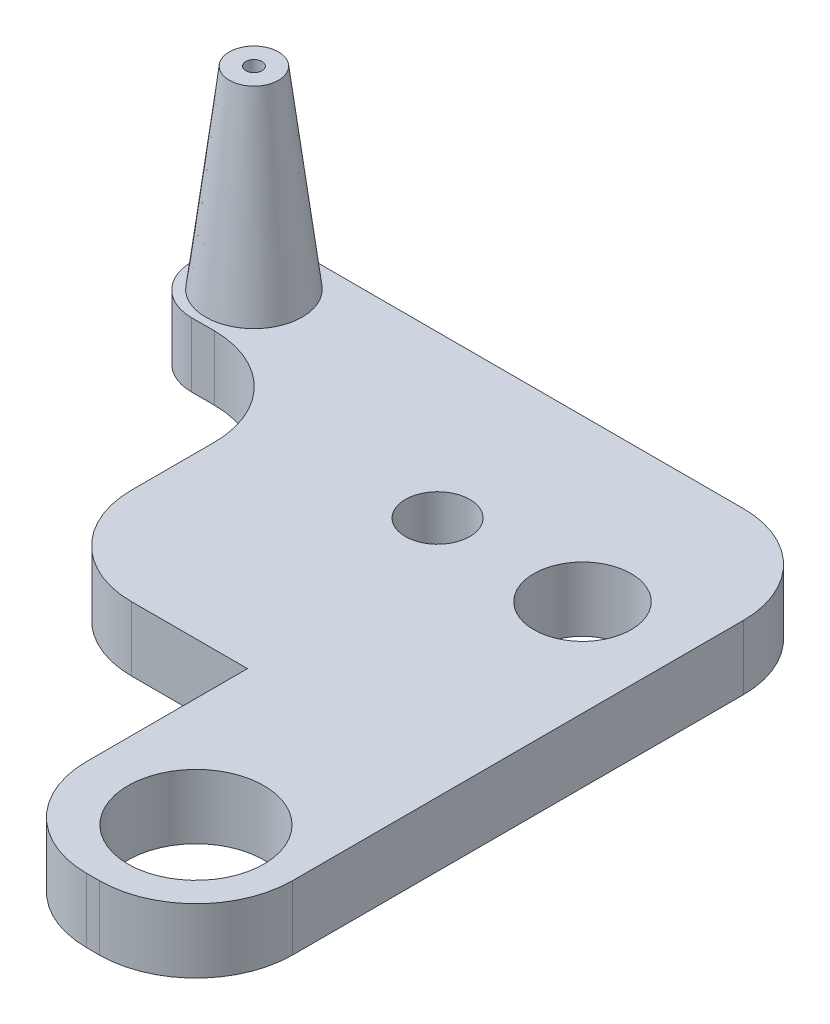
ISO-10303-21;
HEADER;
FILE_DESCRIPTION(('STEP AP214'),'2;1');
FILE_NAME('part.step','',(''),(''),'','','');
FILE_SCHEMA(('AUTOMOTIVE_DESIGN { 1 0 10303 214 1 1 1 1 }'));
ENDSEC;
DATA;
#1=APPLICATION_CONTEXT('core data for automotive mechanical design processes');
#2=APPLICATION_PROTOCOL_DEFINITION('international standard','automotive_design',2000,#1);
#3=PRODUCT_CONTEXT('',#1,'mechanical');
#4=PRODUCT('Part','Part','',(#3));
#5=PRODUCT_RELATED_PRODUCT_CATEGORY('part','',(#4));
#6=PRODUCT_DEFINITION_FORMATION('','',#4);
#7=PRODUCT_DEFINITION_CONTEXT('part definition',#1,'design');
#8=PRODUCT_DEFINITION('design','',#6,#7);
#9=PRODUCT_DEFINITION_SHAPE('','',#8);
#10=(LENGTH_UNIT() NAMED_UNIT(*) SI_UNIT(.MILLI.,.METRE.));
#11=(NAMED_UNIT(*) PLANE_ANGLE_UNIT() SI_UNIT($,.RADIAN.));
#12=(NAMED_UNIT(*) SI_UNIT($,.STERADIAN.) SOLID_ANGLE_UNIT());
#13=UNCERTAINTY_MEASURE_WITH_UNIT(LENGTH_MEASURE(1.E-05),#10,'distance_accuracy_value','');
#14=(GEOMETRIC_REPRESENTATION_CONTEXT(3) GLOBAL_UNCERTAINTY_ASSIGNED_CONTEXT((#13)) GLOBAL_UNIT_ASSIGNED_CONTEXT((#10,
#11,#12)) REPRESENTATION_CONTEXT('',''));
#15=CARTESIAN_POINT('',(0.,0.,0.));
#16=DIRECTION('',(0.,0.,1.));
#17=DIRECTION('',(1.,0.,0.));
#18=AXIS2_PLACEMENT_3D('',#15,#16,#17);
#19=CARTESIAN_POINT('',(0.,10.,0.));
#20=DIRECTION('',(0.,1.,0.));
#21=DIRECTION('',(0.,0.,1.));
#22=AXIS2_PLACEMENT_3D('',#19,#20,#21);
#23=PLANE('',#22);
#24=CARTESIAN_POINT('',(6.49587866097662,10.,-16.5));
#25=DIRECTION('',(0.,1.,0.));
#26=DIRECTION('',(0.,0.,1.));
#27=AXIS2_PLACEMENT_3D('',#24,#25,#26);
#28=CIRCLE('',#27,7.5);
#29=CARTESIAN_POINT('',(6.49587866097662,10.,-8.99999999999998));
#30=VERTEX_POINT('',#29);
#31=EDGE_CURVE('E656',#30,#30,#28,.T.);
#32=ORIENTED_EDGE('',*,*,#31,.F.);
#33=EDGE_LOOP('',(#32));
#34=FACE_BOUND('',#33,.T.);
#35=CARTESIAN_POINT('',(73.9958786609766,10.,60.));
#36=DIRECTION('',(0.,1.,0.));
#37=DIRECTION('',(0.,0.,1.));
#38=AXIS2_PLACEMENT_3D('',#35,#36,#37);
#39=CIRCLE('',#38,10.55);
#40=CARTESIAN_POINT('',(73.9958786609766,10.,70.55));
#41=VERTEX_POINT('',#40);
#42=EDGE_CURVE('E633',#41,#41,#39,.T.);
#43=ORIENTED_EDGE('',*,*,#42,.F.);
#44=EDGE_LOOP('',(#43));
#45=FACE_BOUND('',#44,.T.);
#46=DIRECTION('',(0.,0.,1.));
#47=VECTOR('',#46,1.);
#48=CARTESIAN_POINT('',(-2.00412133902338,10.,-25.));
#49=LINE('',#48,#47);
#50=CARTESIAN_POINT('',(-2.00412133902338,10.,-17.5));
#51=VERTEX_POINT('',#50);
#52=CARTESIAN_POINT('',(-2.00412133902338,10.,-15.3404728062675));
#53=VERTEX_POINT('',#52);
#54=EDGE_CURVE('E307',#51,#53,#49,.T.);
#55=ORIENTED_EDGE('',*,*,#54,.T.);
#56=CARTESIAN_POINT('',(5.49587866097662,10.,-15.3404728062675));
#57=DIRECTION('',(0.,1.,0.));
#58=DIRECTION('',(0.,0.,1.));
#59=AXIS2_PLACEMENT_3D('',#56,#57,#58);
#60=CIRCLE('',#59,7.5);
#61=CARTESIAN_POINT('',(5.49587866097662,10.,-7.84047280626752));
#62=VERTEX_POINT('',#61);
#63=EDGE_CURVE('E52',#53,#62,#60,.T.);
#64=ORIENTED_EDGE('',*,*,#63,.T.);
#65=DIRECTION('',(1.,0.,0.));
#66=VECTOR('',#65,1.);
#67=CARTESIAN_POINT('',(23.9958786609766,10.,-7.84047280626753));
#68=LINE('',#67,#66);
#69=CARTESIAN_POINT('',(8.99587866097663,10.,-7.84047280626752));
#70=VERTEX_POINT('',#69);
#71=EDGE_CURVE('E306',#62,#70,#68,.T.);
#72=ORIENTED_EDGE('',*,*,#71,.T.);
#73=CARTESIAN_POINT('',(8.99587866097663,10.,7.15952719373248));
#74=DIRECTION('',(0.,1.,0.));
#75=DIRECTION('',(0.,0.,1.));
#76=AXIS2_PLACEMENT_3D('',#73,#74,#75);
#77=CIRCLE('',#76,15.);
#78=CARTESIAN_POINT('',(23.9958786609766,10.,7.15952719373247));
#79=VERTEX_POINT('',#78);
#80=EDGE_CURVE('E282',#70,#79,#77,.F.);
#81=ORIENTED_EDGE('',*,*,#80,.T.);
#82=DIRECTION('',(0.,0.,1.));
#83=VECTOR('',#82,1.);
#84=CARTESIAN_POINT('',(23.9958786609766,10.,0.));
#85=LINE('',#84,#83);
#86=CARTESIAN_POINT('',(23.9958786609766,10.,20.0000000000001));
#87=VERTEX_POINT('',#86);
#88=EDGE_CURVE('E166',#79,#87,#85,.T.);
#89=ORIENTED_EDGE('',*,*,#88,.T.);
#90=CARTESIAN_POINT('',(38.9958786609766,10.,20.));
#91=DIRECTION('',(0.,1.,0.));
#92=DIRECTION('',(0.,0.,1.));
#93=AXIS2_PLACEMENT_3D('',#90,#91,#92);
#94=CIRCLE('',#93,15.);
#95=CARTESIAN_POINT('',(38.9958786609766,10.,35.));
#96=VERTEX_POINT('',#95);
#97=EDGE_CURVE('E161',#87,#96,#94,.T.);
#98=ORIENTED_EDGE('',*,*,#97,.T.);
#99=DIRECTION('',(1.,0.,0.));
#100=VECTOR('',#99,1.);
#101=CARTESIAN_POINT('',(23.9958786609766,10.,35.));
#102=LINE('',#101,#100);
#103=CARTESIAN_POINT('',(56.9958786609766,10.,35.));
#104=VERTEX_POINT('',#103);
#105=EDGE_CURVE('E153',#96,#104,#102,.T.);
#106=ORIENTED_EDGE('',*,*,#105,.T.);
#107=DIRECTION('',(0.,0.,1.));
#108=VECTOR('',#107,1.);
#109=CARTESIAN_POINT('',(56.9958786609766,10.,35.));
#110=LINE('',#109,#108);
#111=CARTESIAN_POINT('',(56.9958786609766,10.,60.));
#112=VERTEX_POINT('',#111);
#113=EDGE_CURVE('E157',#104,#112,#110,.T.);
#114=ORIENTED_EDGE('',*,*,#113,.T.);
#115=CARTESIAN_POINT('',(71.9958786609766,10.,60.));
#116=DIRECTION('',(0.,1.,0.));
#117=DIRECTION('',(0.,0.,1.));
#118=AXIS2_PLACEMENT_3D('',#115,#116,#117);
#119=CIRCLE('',#118,15.);
#120=CARTESIAN_POINT('',(71.9958786609766,10.,75.));
#121=VERTEX_POINT('',#120);
#122=EDGE_CURVE('E243',#112,#121,#119,.T.);
#123=ORIENTED_EDGE('',*,*,#122,.T.);
#124=DIRECTION('',(1.,0.,0.));
#125=VECTOR('',#124,1.);
#126=CARTESIAN_POINT('',(56.9958786609766,10.,75.));
#127=LINE('',#126,#125);
#128=CARTESIAN_POINT('',(73.9958786609766,10.,75.));
#129=VERTEX_POINT('',#128);
#130=EDGE_CURVE('E184',#121,#129,#127,.T.);
#131=ORIENTED_EDGE('',*,*,#130,.T.);
#132=CARTESIAN_POINT('',(73.9958786609766,10.,60.));
#133=DIRECTION('',(0.,1.,0.));
#134=DIRECTION('',(0.,0.,1.));
#135=AXIS2_PLACEMENT_3D('',#132,#133,#134);
#136=CIRCLE('',#135,15.);
#137=CARTESIAN_POINT('',(88.9958786609766,10.,60.));
#138=VERTEX_POINT('',#137);
#139=EDGE_CURVE('E246',#129,#138,#136,.T.);
#140=ORIENTED_EDGE('',*,*,#139,.T.);
#141=DIRECTION('',(0.,0.,-1.));
#142=VECTOR('',#141,1.);
#143=CARTESIAN_POINT('',(88.9958786609766,10.,75.));
#144=LINE('',#143,#142);
#145=CARTESIAN_POINT('',(88.9958786609766,10.,-9.99999999999998));
#146=VERTEX_POINT('',#145);
#147=EDGE_CURVE('E178',#138,#146,#144,.T.);
#148=ORIENTED_EDGE('',*,*,#147,.T.);
#149=CARTESIAN_POINT('',(73.9958786609766,10.,-9.99999999999998));
#150=DIRECTION('',(0.,1.,0.));
#151=DIRECTION('',(0.,0.,1.));
#152=AXIS2_PLACEMENT_3D('',#149,#150,#151);
#153=CIRCLE('',#152,15.);
#154=CARTESIAN_POINT('',(73.9958786609766,10.,-25.));
#155=VERTEX_POINT('',#154);
#156=EDGE_CURVE('E249',#146,#155,#153,.T.);
#157=ORIENTED_EDGE('',*,*,#156,.T.);
#158=DIRECTION('',(-1.,0.,0.));
#159=VECTOR('',#158,1.);
#160=CARTESIAN_POINT('',(17.5,10.,-25.));
#161=LINE('',#160,#159);
#162=CARTESIAN_POINT('',(5.49587866097662,10.,-25.));
#163=VERTEX_POINT('',#162);
#164=EDGE_CURVE('E220',#155,#163,#161,.T.);
#165=ORIENTED_EDGE('',*,*,#164,.T.);
#166=CARTESIAN_POINT('',(5.49587866097662,10.,-17.5));
#167=DIRECTION('',(0.,1.,0.));
#168=DIRECTION('',(0.,0.,1.));
#169=AXIS2_PLACEMENT_3D('',#166,#167,#168);
#170=CIRCLE('',#169,7.5);
#171=EDGE_CURVE('E301',#163,#51,#170,.T.);
#172=ORIENTED_EDGE('',*,*,#171,.T.);
#173=EDGE_LOOP('',(#55,#64,#72,#81,#89,#98,#106,#114,#123,#131,#140,#148,#157,#165,#172));
#174=FACE_BOUND('',#173,.T.);
#175=CARTESIAN_POINT('',(51.4958786609766,10.,0.));
#176=DIRECTION('',(0.,1.,0.));
#177=DIRECTION('',(0.,0.,1.));
#178=AXIS2_PLACEMENT_3D('',#175,#176,#177);
#179=CIRCLE('',#178,5.);
#180=CARTESIAN_POINT('',(51.4958786609766,10.,5.00000000000004));
#181=VERTEX_POINT('',#180);
#182=EDGE_CURVE('E198',#181,#181,#179,.T.);
#183=ORIENTED_EDGE('',*,*,#182,.F.);
#184=EDGE_LOOP('',(#183));
#185=FACE_BOUND('',#184,.T.);
#186=CARTESIAN_POINT('',(73.9958786609766,10.,0.));
#187=DIRECTION('',(0.,1.,0.));
#188=DIRECTION('',(0.,0.,1.));
#189=AXIS2_PLACEMENT_3D('',#186,#187,#188);
#190=CIRCLE('',#189,7.55);
#191=CARTESIAN_POINT('',(73.9958786609766,10.,7.55));
#192=VERTEX_POINT('',#191);
#193=EDGE_CURVE('E641',#192,#192,#190,.T.);
#194=ORIENTED_EDGE('',*,*,#193,.F.);
#195=EDGE_LOOP('',(#194));
#196=FACE_BOUND('',#195,.T.);
#197=ADVANCED_FACE('F43',(#34,#45,#174,#185,#196),#23,.T.);
#198=CARTESIAN_POINT('',(0.,0.,0.));
#199=DIRECTION('',(0.,1.,0.));
#200=DIRECTION('',(0.,0.,1.));
#201=AXIS2_PLACEMENT_3D('',#198,#199,#200);
#202=PLANE('',#201);
#203=DIRECTION('',(1.,0.,0.));
#204=VECTOR('',#203,1.);
#205=CARTESIAN_POINT('',(23.9958786609766,0.,-7.84047280626753));
#206=LINE('',#205,#204);
#207=CARTESIAN_POINT('',(5.49587866097662,0.,-7.84047280626752));
#208=VERTEX_POINT('',#207);
#209=CARTESIAN_POINT('',(8.99587866097663,0.,-7.84047280626752));
#210=VERTEX_POINT('',#209);
#211=EDGE_CURVE('E201',#208,#210,#206,.T.);
#212=ORIENTED_EDGE('',*,*,#211,.F.);
#213=CARTESIAN_POINT('',(5.49587866097662,0.,-15.3404728062675));
#214=DIRECTION('',(0.,1.,0.));
#215=DIRECTION('',(0.,0.,1.));
#216=AXIS2_PLACEMENT_3D('',#213,#214,#215);
#217=CIRCLE('',#216,7.5);
#218=CARTESIAN_POINT('',(-2.00412133902338,0.,-15.3404728062675));
#219=VERTEX_POINT('',#218);
#220=EDGE_CURVE('E292',#208,#219,#217,.F.);
#221=ORIENTED_EDGE('',*,*,#220,.T.);
#222=DIRECTION('',(0.,0.,1.));
#223=VECTOR('',#222,1.);
#224=CARTESIAN_POINT('',(-2.00412133902338,0.,-25.));
#225=LINE('',#224,#223);
#226=CARTESIAN_POINT('',(-2.00412133902338,0.,-17.5));
#227=VERTEX_POINT('',#226);
#228=EDGE_CURVE('E197',#227,#219,#225,.T.);
#229=ORIENTED_EDGE('',*,*,#228,.F.);
#230=CARTESIAN_POINT('',(5.49587866097662,0.,-17.5));
#231=DIRECTION('',(0.,1.,0.));
#232=DIRECTION('',(0.,0.,1.));
#233=AXIS2_PLACEMENT_3D('',#230,#231,#232);
#234=CIRCLE('',#233,7.5);
#235=CARTESIAN_POINT('',(5.49587866097662,0.,-25.));
#236=VERTEX_POINT('',#235);
#237=EDGE_CURVE('E289',#227,#236,#234,.F.);
#238=ORIENTED_EDGE('',*,*,#237,.T.);
#239=DIRECTION('',(-1.,0.,0.));
#240=VECTOR('',#239,1.);
#241=CARTESIAN_POINT('',(17.5,0.,-25.));
#242=LINE('',#241,#240);
#243=CARTESIAN_POINT('',(73.9958786609766,0.,-25.));
#244=VERTEX_POINT('',#243);
#245=EDGE_CURVE('E194',#244,#236,#242,.T.);
#246=ORIENTED_EDGE('',*,*,#245,.F.);
#247=CARTESIAN_POINT('',(73.9958786609766,0.,-9.99999999999998));
#248=DIRECTION('',(0.,1.,0.));
#249=DIRECTION('',(0.,0.,1.));
#250=AXIS2_PLACEMENT_3D('',#247,#248,#249);
#251=CIRCLE('',#250,15.);
#252=CARTESIAN_POINT('',(88.9958786609766,0.,-9.99999999999998));
#253=VERTEX_POINT('',#252);
#254=EDGE_CURVE('E230',#244,#253,#251,.F.);
#255=ORIENTED_EDGE('',*,*,#254,.T.);
#256=DIRECTION('',(0.,0.,-1.));
#257=VECTOR('',#256,1.);
#258=CARTESIAN_POINT('',(88.9958786609766,0.,25.));
#259=LINE('',#258,#257);
#260=CARTESIAN_POINT('',(88.9958786609766,0.,60.));
#261=VERTEX_POINT('',#260);
#262=EDGE_CURVE('E217',#261,#253,#259,.T.);
#263=ORIENTED_EDGE('',*,*,#262,.F.);
#264=CARTESIAN_POINT('',(73.9958786609766,0.,60.));
#265=DIRECTION('',(0.,1.,0.));
#266=DIRECTION('',(0.,0.,1.));
#267=AXIS2_PLACEMENT_3D('',#264,#265,#266);
#268=CIRCLE('',#267,15.);
#269=CARTESIAN_POINT('',(73.9958786609766,0.,75.));
#270=VERTEX_POINT('',#269);
#271=EDGE_CURVE('E227',#261,#270,#268,.F.);
#272=ORIENTED_EDGE('',*,*,#271,.T.);
#273=DIRECTION('',(1.,0.,0.));
#274=VECTOR('',#273,1.);
#275=CARTESIAN_POINT('',(56.9958786609766,0.,75.));
#276=LINE('',#275,#274);
#277=CARTESIAN_POINT('',(71.9958786609766,0.,75.));
#278=VERTEX_POINT('',#277);
#279=EDGE_CURVE('E213',#278,#270,#276,.T.);
#280=ORIENTED_EDGE('',*,*,#279,.F.);
#281=CARTESIAN_POINT('',(71.9958786609766,0.,60.));
#282=DIRECTION('',(0.,1.,0.));
#283=DIRECTION('',(0.,0.,1.));
#284=AXIS2_PLACEMENT_3D('',#281,#282,#283);
#285=CIRCLE('',#284,15.);
#286=CARTESIAN_POINT('',(56.9958786609766,0.,60.));
#287=VERTEX_POINT('',#286);
#288=EDGE_CURVE('E224',#278,#287,#285,.F.);
#289=ORIENTED_EDGE('',*,*,#288,.T.);
#290=DIRECTION('',(0.,0.,1.));
#291=VECTOR('',#290,1.);
#292=CARTESIAN_POINT('',(56.9958786609766,0.,35.));
#293=LINE('',#292,#291);
#294=CARTESIAN_POINT('',(56.9958786609766,0.,35.));
#295=VERTEX_POINT('',#294);
#296=EDGE_CURVE('E210',#295,#287,#293,.T.);
#297=ORIENTED_EDGE('',*,*,#296,.F.);
#298=DIRECTION('',(1.,0.,0.));
#299=VECTOR('',#298,1.);
#300=CARTESIAN_POINT('',(23.9958786609766,0.,35.));
#301=LINE('',#300,#299);
#302=CARTESIAN_POINT('',(38.9958786609766,0.,35.));
#303=VERTEX_POINT('',#302);
#304=EDGE_CURVE('E172',#303,#295,#301,.T.);
#305=ORIENTED_EDGE('',*,*,#304,.F.);
#306=CARTESIAN_POINT('',(38.9958786609766,0.,20.));
#307=DIRECTION('',(0.,1.,0.));
#308=DIRECTION('',(0.,0.,1.));
#309=AXIS2_PLACEMENT_3D('',#306,#307,#308);
#310=CIRCLE('',#309,15.);
#311=CARTESIAN_POINT('',(23.9958786609766,0.,20.0000000000001));
#312=VERTEX_POINT('',#311);
#313=EDGE_CURVE('E233',#303,#312,#310,.F.);
#314=ORIENTED_EDGE('',*,*,#313,.T.);
#315=DIRECTION('',(0.,0.,1.));
#316=VECTOR('',#315,1.);
#317=CARTESIAN_POINT('',(23.9958786609766,0.,0.));
#318=LINE('',#317,#316);
#319=CARTESIAN_POINT('',(23.9958786609766,0.,7.15952719373247));
#320=VERTEX_POINT('',#319);
#321=EDGE_CURVE('E204',#320,#312,#318,.T.);
#322=ORIENTED_EDGE('',*,*,#321,.F.);
#323=CARTESIAN_POINT('',(8.99587866097663,0.,7.15952719373248));
#324=DIRECTION('',(0.,1.,0.));
#325=DIRECTION('',(0.,0.,1.));
#326=AXIS2_PLACEMENT_3D('',#323,#324,#325);
#327=CIRCLE('',#326,15.);
#328=EDGE_CURVE('E278',#320,#210,#327,.T.);
#329=ORIENTED_EDGE('',*,*,#328,.T.);
#330=EDGE_LOOP('',(#212,#221,#229,#238,#246,#255,#263,#272,#280,#289,#297,#305,#314,#322,#329));
#331=FACE_BOUND('',#330,.T.);
#332=CARTESIAN_POINT('',(51.4958786609766,0.,0.));
#333=DIRECTION('',(0.,1.,0.));
#334=DIRECTION('',(0.,0.,1.));
#335=AXIS2_PLACEMENT_3D('',#332,#333,#334);
#336=CIRCLE('',#335,5.);
#337=CARTESIAN_POINT('',(51.4958786609766,0.,5.00000000000004));
#338=VERTEX_POINT('',#337);
#339=EDGE_CURVE('E629',#338,#338,#336,.T.);
#340=ORIENTED_EDGE('',*,*,#339,.T.);
#341=EDGE_LOOP('',(#340));
#342=FACE_BOUND('',#341,.T.);
#343=CARTESIAN_POINT('',(73.9958786609766,0.,60.));
#344=DIRECTION('',(0.,1.,0.));
#345=DIRECTION('',(0.,0.,1.));
#346=AXIS2_PLACEMENT_3D('',#343,#344,#345);
#347=CIRCLE('',#346,10.55);
#348=CARTESIAN_POINT('',(73.9958786609766,0.,70.55));
#349=VERTEX_POINT('',#348);
#350=EDGE_CURVE('E637',#349,#349,#347,.T.);
#351=ORIENTED_EDGE('',*,*,#350,.T.);
#352=EDGE_LOOP('',(#351));
#353=FACE_BOUND('',#352,.T.);
#354=CARTESIAN_POINT('',(73.9958786609766,0.,0.));
#355=DIRECTION('',(0.,1.,0.));
#356=DIRECTION('',(0.,0.,1.));
#357=AXIS2_PLACEMENT_3D('',#354,#355,#356);
#358=CIRCLE('',#357,7.55);
#359=CARTESIAN_POINT('',(73.9958786609766,0.,7.55));
#360=VERTEX_POINT('',#359);
#361=EDGE_CURVE('E645',#360,#360,#358,.T.);
#362=ORIENTED_EDGE('',*,*,#361,.T.);
#363=EDGE_LOOP('',(#362));
#364=FACE_BOUND('',#363,.T.);
#365=ADVANCED_FACE('F320',(#331,#342,#353,#364),#202,.F.);
#366=CARTESIAN_POINT('',(17.5,10.,-25.));
#367=DIRECTION('',(0.,0.,1.));
#368=DIRECTION('',(1.,0.,0.));
#369=AXIS2_PLACEMENT_3D('',#366,#367,#368);
#370=PLANE('',#369);
#371=ORIENTED_EDGE('',*,*,#245,.T.);
#372=DIRECTION('',(0.,-1.,0.));
#373=VECTOR('',#372,1.);
#374=CARTESIAN_POINT('',(5.49587866097662,10.,-25.));
#375=LINE('',#374,#373);
#376=EDGE_CURVE('E11',#236,#163,#375,.F.);
#377=ORIENTED_EDGE('',*,*,#376,.T.);
#378=ORIENTED_EDGE('',*,*,#164,.F.);
#379=DIRECTION('',(0.,-1.,0.));
#380=VECTOR('',#379,1.);
#381=CARTESIAN_POINT('',(73.9958786609766,10.,-25.));
#382=LINE('',#381,#380);
#383=EDGE_CURVE('E254',#155,#244,#382,.T.);
#384=ORIENTED_EDGE('',*,*,#383,.T.);
#385=EDGE_LOOP('',(#371,#377,#378,#384));
#386=FACE_BOUND('',#385,.T.);
#387=ADVANCED_FACE('F327',(#386),#370,.F.);
#388=CARTESIAN_POINT('',(-2.00412133902338,10.,-25.));
#389=DIRECTION('',(1.,0.,0.));
#390=DIRECTION('',(0.,0.,-1.));
#391=AXIS2_PLACEMENT_3D('',#388,#389,#390);
#392=PLANE('',#391);
#393=ORIENTED_EDGE('',*,*,#228,.T.);
#394=DIRECTION('',(0.,-1.,0.));
#395=VECTOR('',#394,1.);
#396=CARTESIAN_POINT('',(-2.00412133902338,10.,-15.3404728062675));
#397=LINE('',#396,#395);
#398=EDGE_CURVE('E65',#219,#53,#397,.F.);
#399=ORIENTED_EDGE('',*,*,#398,.T.);
#400=ORIENTED_EDGE('',*,*,#54,.F.);
#401=DIRECTION('',(0.,-1.,0.));
#402=VECTOR('',#401,1.);
#403=CARTESIAN_POINT('',(-2.00412133902338,10.,-17.5));
#404=LINE('',#403,#402);
#405=EDGE_CURVE('E295',#51,#227,#404,.T.);
#406=ORIENTED_EDGE('',*,*,#405,.T.);
#407=EDGE_LOOP('',(#393,#399,#400,#406));
#408=FACE_BOUND('',#407,.T.);
#409=ADVANCED_FACE('F322',(#408),#392,.F.);
#410=CARTESIAN_POINT('',(23.9958786609766,10.,-7.84047280626753));
#411=DIRECTION('',(0.,0.,-1.));
#412=DIRECTION('',(-1.,0.,0.));
#413=AXIS2_PLACEMENT_3D('',#410,#411,#412);
#414=PLANE('',#413);
#415=ORIENTED_EDGE('',*,*,#71,.F.);
#416=DIRECTION('',(0.,-1.,0.));
#417=VECTOR('',#416,1.);
#418=CARTESIAN_POINT('',(5.49587866097662,10.,-7.84047280626752));
#419=LINE('',#418,#417);
#420=EDGE_CURVE('E285',#62,#208,#419,.T.);
#421=ORIENTED_EDGE('',*,*,#420,.T.);
#422=ORIENTED_EDGE('',*,*,#211,.T.);
#423=DIRECTION('',(0.,-1.,0.));
#424=VECTOR('',#423,1.);
#425=CARTESIAN_POINT('',(8.99587866097663,10.,-7.84047280626752));
#426=LINE('',#425,#424);
#427=EDGE_CURVE('E274',#210,#70,#426,.F.);
#428=ORIENTED_EDGE('',*,*,#427,.T.);
#429=EDGE_LOOP('',(#415,#421,#422,#428));
#430=FACE_BOUND('',#429,.T.);
#431=ADVANCED_FACE('F311',(#430),#414,.F.);
#432=CARTESIAN_POINT('',(23.9958786609766,10.,0.));
#433=DIRECTION('',(1.,0.,0.));
#434=DIRECTION('',(0.,0.,-1.));
#435=AXIS2_PLACEMENT_3D('',#432,#433,#434);
#436=PLANE('',#435);
#437=ORIENTED_EDGE('',*,*,#321,.T.);
#438=DIRECTION('',(0.,-1.,0.));
#439=VECTOR('',#438,1.);
#440=CARTESIAN_POINT('',(23.9958786609766,10.,20.0000000000001));
#441=LINE('',#440,#439);
#442=EDGE_CURVE('E240',#312,#87,#441,.F.);
#443=ORIENTED_EDGE('',*,*,#442,.T.);
#444=ORIENTED_EDGE('',*,*,#88,.F.);
#445=DIRECTION('',(0.,-1.,0.));
#446=VECTOR('',#445,1.);
#447=CARTESIAN_POINT('',(23.9958786609766,0.,7.15952719373247));
#448=LINE('',#447,#446);
#449=EDGE_CURVE('E236',#79,#320,#448,.T.);
#450=ORIENTED_EDGE('',*,*,#449,.T.);
#451=EDGE_LOOP('',(#437,#443,#444,#450));
#452=FACE_BOUND('',#451,.T.);
#453=ADVANCED_FACE('F353',(#452),#436,.F.);
#454=CARTESIAN_POINT('',(23.9958786609766,10.,35.));
#455=DIRECTION('',(0.,0.,-1.));
#456=DIRECTION('',(-1.,0.,0.));
#457=AXIS2_PLACEMENT_3D('',#454,#455,#456);
#458=PLANE('',#457);
#459=ORIENTED_EDGE('',*,*,#105,.F.);
#460=DIRECTION('',(0.,-1.,0.));
#461=VECTOR('',#460,1.);
#462=CARTESIAN_POINT('',(38.9958786609766,10.,35.));
#463=LINE('',#462,#461);
#464=EDGE_CURVE('E177',#96,#303,#463,.T.);
#465=ORIENTED_EDGE('',*,*,#464,.T.);
#466=ORIENTED_EDGE('',*,*,#304,.T.);
#467=DIRECTION('',(0.,-1.,0.));
#468=VECTOR('',#467,1.);
#469=CARTESIAN_POINT('',(56.9958786609766,10.,35.));
#470=LINE('',#469,#468);
#471=EDGE_CURVE('E169',#104,#295,#470,.T.);
#472=ORIENTED_EDGE('',*,*,#471,.F.);
#473=EDGE_LOOP('',(#459,#465,#466,#472));
#474=FACE_BOUND('',#473,.T.);
#475=ADVANCED_FACE('F170',(#474),#458,.F.);
#476=CARTESIAN_POINT('',(56.9958786609766,10.,35.));
#477=DIRECTION('',(1.,0.,0.));
#478=DIRECTION('',(0.,0.,-1.));
#479=AXIS2_PLACEMENT_3D('',#476,#477,#478);
#480=PLANE('',#479);
#481=ORIENTED_EDGE('',*,*,#296,.T.);
#482=DIRECTION('',(0.,-1.,0.));
#483=VECTOR('',#482,1.);
#484=CARTESIAN_POINT('',(56.9958786609766,10.,60.));
#485=LINE('',#484,#483);
#486=EDGE_CURVE('E182',#287,#112,#485,.F.);
#487=ORIENTED_EDGE('',*,*,#486,.T.);
#488=ORIENTED_EDGE('',*,*,#113,.F.);
#489=ORIENTED_EDGE('',*,*,#471,.T.);
#490=EDGE_LOOP('',(#481,#487,#488,#489));
#491=FACE_BOUND('',#490,.T.);
#492=ADVANCED_FACE('F180',(#491),#480,.F.);
#493=CARTESIAN_POINT('',(56.9958786609766,10.,75.));
#494=DIRECTION('',(0.,0.,-1.));
#495=DIRECTION('',(-1.,0.,0.));
#496=AXIS2_PLACEMENT_3D('',#493,#494,#495);
#497=PLANE('',#496);
#498=ORIENTED_EDGE('',*,*,#279,.T.);
#499=DIRECTION('',(0.,-1.,0.));
#500=VECTOR('',#499,1.);
#501=CARTESIAN_POINT('',(73.9958786609766,10.,75.));
#502=LINE('',#501,#500);
#503=EDGE_CURVE('E269',#270,#129,#502,.F.);
#504=ORIENTED_EDGE('',*,*,#503,.T.);
#505=ORIENTED_EDGE('',*,*,#130,.F.);
#506=DIRECTION('',(0.,-1.,0.));
#507=VECTOR('',#506,1.);
#508=CARTESIAN_POINT('',(71.9958786609766,10.,75.));
#509=LINE('',#508,#507);
#510=EDGE_CURVE('E265',#121,#278,#509,.T.);
#511=ORIENTED_EDGE('',*,*,#510,.T.);
#512=EDGE_LOOP('',(#498,#504,#505,#511));
#513=FACE_BOUND('',#512,.T.);
#514=ADVANCED_FACE('F344',(#513),#497,.F.);
#515=CARTESIAN_POINT('',(88.9958786609766,10.,25.));
#516=DIRECTION('',(-1.,0.,0.));
#517=DIRECTION('',(0.,0.,1.));
#518=AXIS2_PLACEMENT_3D('',#515,#516,#517);
#519=PLANE('',#518);
#520=ORIENTED_EDGE('',*,*,#262,.T.);
#521=DIRECTION('',(0.,-1.,0.));
#522=VECTOR('',#521,1.);
#523=CARTESIAN_POINT('',(88.9958786609766,10.,-9.99999999999998));
#524=LINE('',#523,#522);
#525=EDGE_CURVE('E262',#253,#146,#524,.F.);
#526=ORIENTED_EDGE('',*,*,#525,.T.);
#527=ORIENTED_EDGE('',*,*,#147,.F.);
#528=DIRECTION('',(0.,-1.,0.));
#529=VECTOR('',#528,1.);
#530=CARTESIAN_POINT('',(88.9958786609766,10.,60.));
#531=LINE('',#530,#529);
#532=EDGE_CURVE('E258',#138,#261,#531,.T.);
#533=ORIENTED_EDGE('',*,*,#532,.T.);
#534=EDGE_LOOP('',(#520,#526,#527,#533));
#535=FACE_BOUND('',#534,.T.);
#536=ADVANCED_FACE('F335',(#535),#519,.F.);
#537=CARTESIAN_POINT('',(51.4958786609766,10.,0.));
#538=DIRECTION('',(0.,-1.,0.));
#539=DIRECTION('',(0.,0.,-1.));
#540=AXIS2_PLACEMENT_3D('',#537,#538,#539);
#541=CYLINDRICAL_SURFACE('',#540,5.);
#542=ORIENTED_EDGE('',*,*,#182,.T.);
#543=EDGE_LOOP('',(#542));
#544=FACE_BOUND('',#543,.T.);
#545=ORIENTED_EDGE('',*,*,#339,.F.);
#546=EDGE_LOOP('',(#545));
#547=FACE_BOUND('',#546,.T.);
#548=ADVANCED_FACE('F379',(#544,#547),#541,.F.);
#549=CARTESIAN_POINT('',(73.9958786609766,10.,60.));
#550=DIRECTION('',(0.,-1.,0.));
#551=DIRECTION('',(0.,0.,-1.));
#552=AXIS2_PLACEMENT_3D('',#549,#550,#551);
#553=CYLINDRICAL_SURFACE('',#552,10.55);
#554=ORIENTED_EDGE('',*,*,#42,.T.);
#555=EDGE_LOOP('',(#554));
#556=FACE_BOUND('',#555,.T.);
#557=ORIENTED_EDGE('',*,*,#350,.F.);
#558=EDGE_LOOP('',(#557));
#559=FACE_BOUND('',#558,.T.);
#560=ADVANCED_FACE('F436',(#556,#559),#553,.F.);
#561=CARTESIAN_POINT('',(73.9958786609766,10.,0.));
#562=DIRECTION('',(0.,-1.,0.));
#563=DIRECTION('',(0.,0.,-1.));
#564=AXIS2_PLACEMENT_3D('',#561,#562,#563);
#565=CYLINDRICAL_SURFACE('',#564,7.55);
#566=ORIENTED_EDGE('',*,*,#193,.T.);
#567=EDGE_LOOP('',(#566));
#568=FACE_BOUND('',#567,.T.);
#569=ORIENTED_EDGE('',*,*,#361,.F.);
#570=EDGE_LOOP('',(#569));
#571=FACE_BOUND('',#570,.T.);
#572=ADVANCED_FACE('F443',(#568,#571),#565,.F.);
#573=CARTESIAN_POINT('',(6.49587866097662,10.,-16.5));
#574=DIRECTION('',(0.,-1.,0.));
#575=DIRECTION('',(0.,0.,1.));
#576=AXIS2_PLACEMENT_3D('',#573,#574,#575);
#577=CONICAL_SURFACE('',#576,7.5,0.122173047639603);
#578=CARTESIAN_POINT('',(6.49587866097662,40.,-16.5));
#579=DIRECTION('',(0.,1.,0.));
#580=DIRECTION('',(0.,0.,1.));
#581=AXIS2_PLACEMENT_3D('',#578,#579,#580);
#582=CIRCLE('',#581,3.81646317291285);
#583=CARTESIAN_POINT('',(6.49587866097662,40.,-12.6835368270871));
#584=VERTEX_POINT('',#583);
#585=EDGE_CURVE('E649',#584,#584,#582,.T.);
#586=ORIENTED_EDGE('',*,*,#585,.F.);
#587=EDGE_LOOP('',(#586));
#588=FACE_BOUND('',#587,.T.);
#589=ORIENTED_EDGE('',*,*,#31,.T.);
#590=EDGE_LOOP('',(#589));
#591=FACE_BOUND('',#590,.T.);
#592=ADVANCED_FACE('F450',(#588,#591),#577,.T.);
#593=CARTESIAN_POINT('',(6.49587866097662,40.,-16.5));
#594=DIRECTION('',(0.,1.,0.));
#595=DIRECTION('',(0.,0.,1.));
#596=AXIS2_PLACEMENT_3D('',#593,#594,#595);
#597=PLANE('',#596);
#598=CARTESIAN_POINT('',(6.49587866097662,40.,-16.5));
#599=DIRECTION('',(0.,1.,0.));
#600=DIRECTION('',(0.,0.,1.));
#601=AXIS2_PLACEMENT_3D('',#598,#599,#600);
#602=CIRCLE('',#601,1.25);
#603=CARTESIAN_POINT('',(6.49587866097662,40.,-15.25));
#604=VERTEX_POINT('',#603);
#605=EDGE_CURVE('E661',#604,#604,#602,.T.);
#606=ORIENTED_EDGE('',*,*,#605,.F.);
#607=EDGE_LOOP('',(#606));
#608=FACE_BOUND('',#607,.T.);
#609=ORIENTED_EDGE('',*,*,#585,.T.);
#610=EDGE_LOOP('',(#609));
#611=FACE_BOUND('',#610,.T.);
#612=ADVANCED_FACE('F458',(#608,#611),#597,.T.);
#613=CARTESIAN_POINT('',(6.49587866097662,30.,-16.5));
#614=DIRECTION('',(0.,1.,0.));
#615=DIRECTION('',(0.,0.,1.));
#616=AXIS2_PLACEMENT_3D('',#613,#614,#615);
#617=CYLINDRICAL_SURFACE('',#616,1.25);
#618=CARTESIAN_POINT('',(6.49587866097662,30.,-16.5));
#619=DIRECTION('',(0.,1.,0.));
#620=DIRECTION('',(0.,0.,1.));
#621=AXIS2_PLACEMENT_3D('',#618,#619,#620);
#622=CIRCLE('',#621,1.25);
#623=CARTESIAN_POINT('',(6.49587866097662,30.,-15.25));
#624=VERTEX_POINT('',#623);
#625=EDGE_CURVE('E660',#624,#624,#622,.T.);
#626=ORIENTED_EDGE('',*,*,#625,.F.);
#627=EDGE_LOOP('',(#626));
#628=FACE_BOUND('',#627,.T.);
#629=ORIENTED_EDGE('',*,*,#605,.T.);
#630=EDGE_LOOP('',(#629));
#631=FACE_BOUND('',#630,.T.);
#632=ADVANCED_FACE('F365',(#628,#631),#617,.F.);
#633=CARTESIAN_POINT('',(6.49587866097662,30.,-16.5));
#634=DIRECTION('',(0.,1.,0.));
#635=DIRECTION('',(0.,0.,1.));
#636=AXIS2_PLACEMENT_3D('',#633,#634,#635);
#637=PLANE('',#636);
#638=ORIENTED_EDGE('',*,*,#625,.T.);
#639=EDGE_LOOP('',(#638));
#640=FACE_BOUND('',#639,.T.);
#641=ADVANCED_FACE('F358',(#640),#637,.T.);
#642=CARTESIAN_POINT('',(38.9958786609766,10.,20.));
#643=DIRECTION('',(0.,-1.,0.));
#644=DIRECTION('',(0.,0.,-1.));
#645=AXIS2_PLACEMENT_3D('',#642,#643,#644);
#646=CYLINDRICAL_SURFACE('',#645,15.);
#647=ORIENTED_EDGE('',*,*,#97,.F.);
#648=ORIENTED_EDGE('',*,*,#442,.F.);
#649=ORIENTED_EDGE('',*,*,#313,.F.);
#650=ORIENTED_EDGE('',*,*,#464,.F.);
#651=EDGE_LOOP('',(#647,#648,#649,#650));
#652=FACE_BOUND('',#651,.T.);
#653=ADVANCED_FACE('F356',(#652),#646,.T.);
#654=CARTESIAN_POINT('',(73.9958786609766,10.,-9.99999999999998));
#655=DIRECTION('',(0.,-1.,0.));
#656=DIRECTION('',(0.,0.,-1.));
#657=AXIS2_PLACEMENT_3D('',#654,#655,#656);
#658=CYLINDRICAL_SURFACE('',#657,15.);
#659=ORIENTED_EDGE('',*,*,#156,.F.);
#660=ORIENTED_EDGE('',*,*,#525,.F.);
#661=ORIENTED_EDGE('',*,*,#254,.F.);
#662=ORIENTED_EDGE('',*,*,#383,.F.);
#663=EDGE_LOOP('',(#659,#660,#661,#662));
#664=FACE_BOUND('',#663,.T.);
#665=ADVANCED_FACE('F331',(#664),#658,.T.);
#666=CARTESIAN_POINT('',(73.9958786609766,10.,60.));
#667=DIRECTION('',(0.,-1.,0.));
#668=DIRECTION('',(0.,0.,-1.));
#669=AXIS2_PLACEMENT_3D('',#666,#667,#668);
#670=CYLINDRICAL_SURFACE('',#669,15.);
#671=ORIENTED_EDGE('',*,*,#139,.F.);
#672=ORIENTED_EDGE('',*,*,#503,.F.);
#673=ORIENTED_EDGE('',*,*,#271,.F.);
#674=ORIENTED_EDGE('',*,*,#532,.F.);
#675=EDGE_LOOP('',(#671,#672,#673,#674));
#676=FACE_BOUND('',#675,.T.);
#677=ADVANCED_FACE('F340',(#676),#670,.T.);
#678=CARTESIAN_POINT('',(71.9958786609766,10.,60.));
#679=DIRECTION('',(0.,-1.,0.));
#680=DIRECTION('',(0.,0.,-1.));
#681=AXIS2_PLACEMENT_3D('',#678,#679,#680);
#682=CYLINDRICAL_SURFACE('',#681,15.);
#683=ORIENTED_EDGE('',*,*,#122,.F.);
#684=ORIENTED_EDGE('',*,*,#486,.F.);
#685=ORIENTED_EDGE('',*,*,#288,.F.);
#686=ORIENTED_EDGE('',*,*,#510,.F.);
#687=EDGE_LOOP('',(#683,#684,#685,#686));
#688=FACE_BOUND('',#687,.T.);
#689=ADVANCED_FACE('F348',(#688),#682,.T.);
#690=CARTESIAN_POINT('',(8.99587866097663,10.,7.15952719373248));
#691=DIRECTION('',(0.,1.,0.));
#692=DIRECTION('',(0.,0.,1.));
#693=AXIS2_PLACEMENT_3D('',#690,#691,#692);
#694=CYLINDRICAL_SURFACE('',#693,15.);
#695=ORIENTED_EDGE('',*,*,#80,.F.);
#696=ORIENTED_EDGE('',*,*,#427,.F.);
#697=ORIENTED_EDGE('',*,*,#328,.F.);
#698=ORIENTED_EDGE('',*,*,#449,.F.);
#699=EDGE_LOOP('',(#695,#696,#697,#698));
#700=FACE_BOUND('',#699,.T.);
#701=ADVANCED_FACE('F515',(#700),#694,.F.);
#702=CARTESIAN_POINT('',(5.49587866097662,10.,-15.3404728062675));
#703=DIRECTION('',(0.,-1.,0.));
#704=DIRECTION('',(0.,0.,-1.));
#705=AXIS2_PLACEMENT_3D('',#702,#703,#704);
#706=CYLINDRICAL_SURFACE('',#705,7.5);
#707=ORIENTED_EDGE('',*,*,#63,.F.);
#708=ORIENTED_EDGE('',*,*,#398,.F.);
#709=ORIENTED_EDGE('',*,*,#220,.F.);
#710=ORIENTED_EDGE('',*,*,#420,.F.);
#711=EDGE_LOOP('',(#707,#708,#709,#710));
#712=FACE_BOUND('',#711,.T.);
#713=ADVANCED_FACE('F317',(#712),#706,.T.);
#714=CARTESIAN_POINT('',(5.49587866097662,10.,-17.5));
#715=DIRECTION('',(0.,-1.,0.));
#716=DIRECTION('',(0.,0.,-1.));
#717=AXIS2_PLACEMENT_3D('',#714,#715,#716);
#718=CYLINDRICAL_SURFACE('',#717,7.5);
#719=ORIENTED_EDGE('',*,*,#171,.F.);
#720=ORIENTED_EDGE('',*,*,#376,.F.);
#721=ORIENTED_EDGE('',*,*,#237,.F.);
#722=ORIENTED_EDGE('',*,*,#405,.F.);
#723=EDGE_LOOP('',(#719,#720,#721,#722));
#724=FACE_BOUND('',#723,.T.);
#725=ADVANCED_FACE('F45',(#724),#718,.T.);
#726=CLOSED_SHELL('',(#197,#365,#387,#409,#431,#453,#475,#492,#514,#536,#548,#560,#572,#592,
#612,#632,#641,#653,#665,#677,#689,#701,#713,#725));
#727=MANIFOLD_SOLID_BREP('B2',#726);
#728=ADVANCED_BREP_SHAPE_REPRESENTATION('',(#18,#727),#14);
#729=SHAPE_DEFINITION_REPRESENTATION(#9,#728);
ENDSEC;
END-ISO-10303-21;
